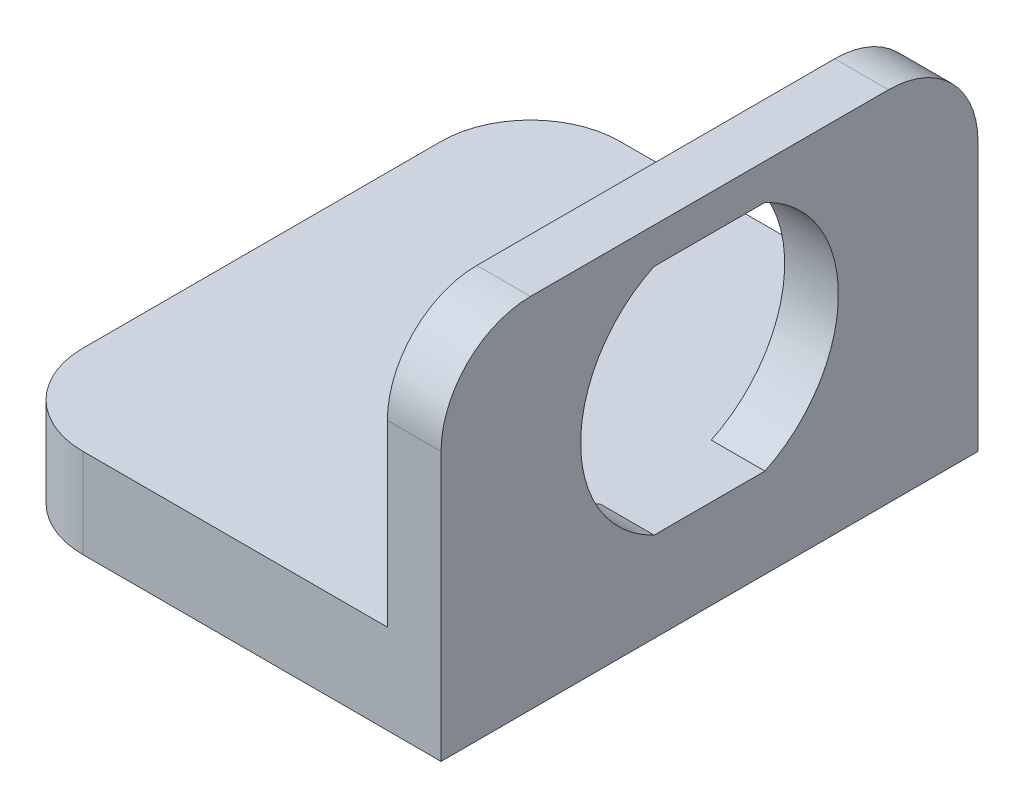
ISO-10303-21;
HEADER;
FILE_DESCRIPTION(('STEP AP214'),'2;1');
FILE_NAME('part.step','',(''),(''),'','','');
FILE_SCHEMA(('AUTOMOTIVE_DESIGN { 1 0 10303 214 1 1 1 1 }'));
ENDSEC;
DATA;
#1=APPLICATION_CONTEXT('core data for automotive mechanical design processes');
#2=APPLICATION_PROTOCOL_DEFINITION('international standard','automotive_design',2000,#1);
#3=PRODUCT_CONTEXT('',#1,'mechanical');
#4=PRODUCT('Part','Part','',(#3));
#5=PRODUCT_RELATED_PRODUCT_CATEGORY('part','',(#4));
#6=PRODUCT_DEFINITION_FORMATION('','',#4);
#7=PRODUCT_DEFINITION_CONTEXT('part definition',#1,'design');
#8=PRODUCT_DEFINITION('design','',#6,#7);
#9=PRODUCT_DEFINITION_SHAPE('','',#8);
#10=(LENGTH_UNIT() NAMED_UNIT(*) SI_UNIT(.MILLI.,.METRE.));
#11=(NAMED_UNIT(*) PLANE_ANGLE_UNIT() SI_UNIT($,.RADIAN.));
#12=(NAMED_UNIT(*) SI_UNIT($,.STERADIAN.) SOLID_ANGLE_UNIT());
#13=UNCERTAINTY_MEASURE_WITH_UNIT(LENGTH_MEASURE(1.E-05),#10,'distance_accuracy_value','');
#14=(GEOMETRIC_REPRESENTATION_CONTEXT(3) GLOBAL_UNCERTAINTY_ASSIGNED_CONTEXT((#13)) GLOBAL_UNIT_ASSIGNED_CONTEXT((#10,
#11,#12)) REPRESENTATION_CONTEXT('',''));
#15=CARTESIAN_POINT('',(0.,0.,0.));
#16=DIRECTION('',(0.,0.,1.));
#17=DIRECTION('',(1.,0.,0.));
#18=AXIS2_PLACEMENT_3D('',#15,#16,#17);
#19=CARTESIAN_POINT('',(-31.75,0.,38.1));
#20=DIRECTION('',(0.,1.,0.));
#21=DIRECTION('',(0.,0.,1.));
#22=AXIS2_PLACEMENT_3D('',#19,#20,#21);
#23=PLANE('',#22);
#24=CARTESIAN_POINT('',(-16.51,0.,19.05));
#25=DIRECTION('',(0.,1.,0.));
#26=DIRECTION('',(0.,0.,1.));
#27=AXIS2_PLACEMENT_3D('',#24,#25,#26);
#28=CIRCLE('',#27,2.5527);
#29=CARTESIAN_POINT('',(-16.51,0.,21.6027));
#30=VERTEX_POINT('',#29);
#31=EDGE_CURVE('E180',#30,#30,#28,.T.);
#32=ORIENTED_EDGE('',*,*,#31,.T.);
#33=EDGE_LOOP('',(#32));
#34=FACE_BOUND('',#33,.T.);
#35=DIRECTION('',(0.,0.,-1.));
#36=VECTOR('',#35,1.);
#37=CARTESIAN_POINT('',(-31.75,0.,38.1));
#38=LINE('',#37,#36);
#39=CARTESIAN_POINT('',(-31.75,0.,31.75));
#40=VERTEX_POINT('',#39);
#41=CARTESIAN_POINT('',(-31.75,0.,6.35000000000002));
#42=VERTEX_POINT('',#41);
#43=EDGE_CURVE('E195',#40,#42,#38,.T.);
#44=ORIENTED_EDGE('',*,*,#43,.T.);
#45=CARTESIAN_POINT('',(-25.4,0.,6.35));
#46=DIRECTION('',(0.,1.,0.));
#47=DIRECTION('',(0.,0.,1.));
#48=AXIS2_PLACEMENT_3D('',#45,#46,#47);
#49=CIRCLE('',#48,6.35);
#50=CARTESIAN_POINT('',(-25.4,0.,0.));
#51=VERTEX_POINT('',#50);
#52=EDGE_CURVE('E228',#42,#51,#49,.F.);
#53=ORIENTED_EDGE('',*,*,#52,.T.);
#54=DIRECTION('',(1.,0.,0.));
#55=VECTOR('',#54,1.);
#56=CARTESIAN_POINT('',(-31.75,0.,0.));
#57=LINE('',#56,#55);
#58=CARTESIAN_POINT('',(0.,0.,0.));
#59=VERTEX_POINT('',#58);
#60=EDGE_CURVE('E183',#51,#59,#57,.T.);
#61=ORIENTED_EDGE('',*,*,#60,.T.);
#62=DIRECTION('',(0.,0.,-1.));
#63=VECTOR('',#62,1.);
#64=CARTESIAN_POINT('',(0.,0.,38.1));
#65=LINE('',#64,#63);
#66=CARTESIAN_POINT('',(0.,0.,38.1));
#67=VERTEX_POINT('',#66);
#68=EDGE_CURVE('E215',#67,#59,#65,.T.);
#69=ORIENTED_EDGE('',*,*,#68,.F.);
#70=DIRECTION('',(1.,0.,0.));
#71=VECTOR('',#70,1.);
#72=CARTESIAN_POINT('',(-31.75,0.,38.1));
#73=LINE('',#72,#71);
#74=CARTESIAN_POINT('',(-25.4,0.,38.1));
#75=VERTEX_POINT('',#74);
#76=EDGE_CURVE('E184',#75,#67,#73,.T.);
#77=ORIENTED_EDGE('',*,*,#76,.F.);
#78=CARTESIAN_POINT('',(-25.4,0.,31.75));
#79=DIRECTION('',(0.,1.,0.));
#80=DIRECTION('',(0.,0.,1.));
#81=AXIS2_PLACEMENT_3D('',#78,#79,#80);
#82=CIRCLE('',#81,6.35);
#83=EDGE_CURVE('E226',#75,#40,#82,.F.);
#84=ORIENTED_EDGE('',*,*,#83,.T.);
#85=EDGE_LOOP('',(#44,#53,#61,#69,#77,#84));
#86=FACE_BOUND('',#85,.T.);
#87=ADVANCED_FACE('F35',(#34,#86),#23,.F.);
#88=CARTESIAN_POINT('',(0.,0.,38.1));
#89=DIRECTION('',(-1.,0.,0.));
#90=DIRECTION('',(0.,0.,1.));
#91=AXIS2_PLACEMENT_3D('',#88,#89,#90);
#92=PLANE('',#91);
#93=DIRECTION('',(0.,0.,-1.));
#94=VECTOR('',#93,1.);
#95=CARTESIAN_POINT('',(0.,6.35,15.1170989079307));
#96=LINE('',#95,#94);
#97=CARTESIAN_POINT('',(0.,6.35,22.9829010920693));
#98=VERTEX_POINT('',#97);
#99=CARTESIAN_POINT('',(0.,6.35,15.1170989079307));
#100=VERTEX_POINT('',#99);
#101=EDGE_CURVE('E153',#98,#100,#96,.T.);
#102=ORIENTED_EDGE('',*,*,#101,.F.);
#103=CARTESIAN_POINT('',(0.,14.605,19.05));
#104=DIRECTION('',(1.,0.,0.));
#105=DIRECTION('',(0.,0.,-1.));
#106=AXIS2_PLACEMENT_3D('',#103,#104,#105);
#107=CIRCLE('',#106,9.144);
#108=CARTESIAN_POINT('',(0.,22.86,22.9829010920693));
#109=VERTEX_POINT('',#108);
#110=EDGE_CURVE('E160',#109,#98,#107,.T.);
#111=ORIENTED_EDGE('',*,*,#110,.F.);
#112=DIRECTION('',(0.,0.,1.));
#113=VECTOR('',#112,1.);
#114=CARTESIAN_POINT('',(0.,22.86,22.9829010920693));
#115=LINE('',#114,#113);
#116=CARTESIAN_POINT('',(0.,22.86,15.1170989079307));
#117=VERTEX_POINT('',#116);
#118=EDGE_CURVE('E164',#117,#109,#115,.T.);
#119=ORIENTED_EDGE('',*,*,#118,.F.);
#120=CARTESIAN_POINT('',(0.,14.605,19.05));
#121=DIRECTION('',(1.,0.,0.));
#122=DIRECTION('',(0.,0.,-1.));
#123=AXIS2_PLACEMENT_3D('',#120,#121,#122);
#124=CIRCLE('',#123,9.144);
#125=EDGE_CURVE('E141',#100,#117,#124,.T.);
#126=ORIENTED_EDGE('',*,*,#125,.F.);
#127=EDGE_LOOP('',(#102,#111,#119,#126));
#128=FACE_BOUND('',#127,.T.);
#129=DIRECTION('',(0.,1.,0.));
#130=VECTOR('',#129,1.);
#131=CARTESIAN_POINT('',(0.,0.,0.));
#132=LINE('',#131,#130);
#133=CARTESIAN_POINT('',(0.,19.05,0.));
#134=VERTEX_POINT('',#133);
#135=EDGE_CURVE('E197',#59,#134,#132,.T.);
#136=ORIENTED_EDGE('',*,*,#135,.T.);
#137=CARTESIAN_POINT('',(0.,19.05,6.35));
#138=DIRECTION('',(-1.,0.,0.));
#139=DIRECTION('',(0.,0.,1.));
#140=AXIS2_PLACEMENT_3D('',#137,#138,#139);
#141=CIRCLE('',#140,6.35);
#142=CARTESIAN_POINT('',(0.,25.4,6.35000000000002));
#143=VERTEX_POINT('',#142);
#144=EDGE_CURVE('E11',#134,#143,#141,.F.);
#145=ORIENTED_EDGE('',*,*,#144,.T.);
#146=DIRECTION('',(0.,0.,-1.));
#147=VECTOR('',#146,1.);
#148=CARTESIAN_POINT('',(0.,25.4,38.1));
#149=LINE('',#148,#147);
#150=CARTESIAN_POINT('',(0.,25.4,31.75));
#151=VERTEX_POINT('',#150);
#152=EDGE_CURVE('E213',#151,#143,#149,.T.);
#153=ORIENTED_EDGE('',*,*,#152,.F.);
#154=CARTESIAN_POINT('',(0.,19.05,31.75));
#155=DIRECTION('',(-1.,0.,0.));
#156=DIRECTION('',(0.,0.,1.));
#157=AXIS2_PLACEMENT_3D('',#154,#155,#156);
#158=CIRCLE('',#157,6.35);
#159=CARTESIAN_POINT('',(0.,19.05,38.1));
#160=VERTEX_POINT('',#159);
#161=EDGE_CURVE('E43',#151,#160,#158,.F.);
#162=ORIENTED_EDGE('',*,*,#161,.T.);
#163=DIRECTION('',(0.,1.,0.));
#164=VECTOR('',#163,1.);
#165=CARTESIAN_POINT('',(0.,0.,38.1));
#166=LINE('',#165,#164);
#167=EDGE_CURVE('E186',#67,#160,#166,.T.);
#168=ORIENTED_EDGE('',*,*,#167,.F.);
#169=ORIENTED_EDGE('',*,*,#68,.T.);
#170=EDGE_LOOP('',(#136,#145,#153,#162,#168,#169));
#171=FACE_BOUND('',#170,.T.);
#172=ADVANCED_FACE('F162',(#128,#171),#92,.F.);
#173=CARTESIAN_POINT('',(0.,25.4,38.1));
#174=DIRECTION('',(0.,-1.,0.));
#175=DIRECTION('',(0.,0.,-1.));
#176=AXIS2_PLACEMENT_3D('',#173,#174,#175);
#177=PLANE('',#176);
#178=ORIENTED_EDGE('',*,*,#152,.T.);
#179=DIRECTION('',(-1.,0.,0.));
#180=VECTOR('',#179,1.);
#181=CARTESIAN_POINT('',(0.,25.4,6.35));
#182=LINE('',#181,#180);
#183=CARTESIAN_POINT('',(-3.81,25.4,6.35000000000002));
#184=VERTEX_POINT('',#183);
#185=EDGE_CURVE('E245',#143,#184,#182,.T.);
#186=ORIENTED_EDGE('',*,*,#185,.T.);
#187=DIRECTION('',(0.,0.,-1.));
#188=VECTOR('',#187,1.);
#189=CARTESIAN_POINT('',(-3.81,25.4,38.1));
#190=LINE('',#189,#188);
#191=CARTESIAN_POINT('',(-3.81,25.4,31.75));
#192=VERTEX_POINT('',#191);
#193=EDGE_CURVE('E210',#192,#184,#190,.T.);
#194=ORIENTED_EDGE('',*,*,#193,.F.);
#195=DIRECTION('',(-1.,0.,0.));
#196=VECTOR('',#195,1.);
#197=CARTESIAN_POINT('',(0.,25.4,31.75));
#198=LINE('',#197,#196);
#199=EDGE_CURVE('E55',#192,#151,#198,.F.);
#200=ORIENTED_EDGE('',*,*,#199,.T.);
#201=EDGE_LOOP('',(#178,#186,#194,#200));
#202=FACE_BOUND('',#201,.T.);
#203=ADVANCED_FACE('F263',(#202),#177,.F.);
#204=CARTESIAN_POINT('',(-3.81,25.4,38.1));
#205=DIRECTION('',(1.,0.,0.));
#206=DIRECTION('',(0.,1.,0.));
#207=AXIS2_PLACEMENT_3D('',#204,#205,#206);
#208=PLANE('',#207);
#209=ORIENTED_EDGE('',*,*,#193,.T.);
#210=CARTESIAN_POINT('',(-3.81,19.05,6.35));
#211=DIRECTION('',(1.,0.,0.));
#212=DIRECTION('',(0.,1.,0.));
#213=AXIS2_PLACEMENT_3D('',#210,#211,#212);
#214=CIRCLE('',#213,6.35);
#215=CARTESIAN_POINT('',(-3.81,19.05,0.));
#216=VERTEX_POINT('',#215);
#217=EDGE_CURVE('E250',#184,#216,#214,.F.);
#218=ORIENTED_EDGE('',*,*,#217,.T.);
#219=DIRECTION('',(0.,-1.,0.));
#220=VECTOR('',#219,1.);
#221=CARTESIAN_POINT('',(-3.81,25.4,0.));
#222=LINE('',#221,#220);
#223=CARTESIAN_POINT('',(-3.81,6.35,0.));
#224=VERTEX_POINT('',#223);
#225=EDGE_CURVE('E199',#216,#224,#222,.T.);
#226=ORIENTED_EDGE('',*,*,#225,.T.);
#227=DIRECTION('',(0.,0.,-1.));
#228=VECTOR('',#227,1.);
#229=CARTESIAN_POINT('',(-3.81,6.35,38.1));
#230=LINE('',#229,#228);
#231=CARTESIAN_POINT('',(-3.81,6.35,15.1170989079307));
#232=VERTEX_POINT('',#231);
#233=EDGE_CURVE('E207',#232,#224,#230,.T.);
#234=ORIENTED_EDGE('',*,*,#233,.F.);
#235=CARTESIAN_POINT('',(-3.81,14.605,19.05));
#236=DIRECTION('',(1.,0.,0.));
#237=DIRECTION('',(0.,1.,0.));
#238=AXIS2_PLACEMENT_3D('',#235,#236,#237);
#239=CIRCLE('',#238,9.144);
#240=CARTESIAN_POINT('',(-3.81,22.86,15.1170989079307));
#241=VERTEX_POINT('',#240);
#242=EDGE_CURVE('E144',#232,#241,#239,.T.);
#243=ORIENTED_EDGE('',*,*,#242,.T.);
#244=DIRECTION('',(0.,0.,1.));
#245=VECTOR('',#244,1.);
#246=CARTESIAN_POINT('',(-3.81,22.86,38.1));
#247=LINE('',#246,#245);
#248=CARTESIAN_POINT('',(-3.81,22.86,22.9829010920693));
#249=VERTEX_POINT('',#248);
#250=EDGE_CURVE('E218',#241,#249,#247,.T.);
#251=ORIENTED_EDGE('',*,*,#250,.T.);
#252=CARTESIAN_POINT('',(-3.81,14.605,19.05));
#253=DIRECTION('',(1.,0.,0.));
#254=DIRECTION('',(0.,1.,0.));
#255=AXIS2_PLACEMENT_3D('',#252,#253,#254);
#256=CIRCLE('',#255,9.144);
#257=CARTESIAN_POINT('',(-3.81,6.35,22.9829010920693));
#258=VERTEX_POINT('',#257);
#259=EDGE_CURVE('E174',#249,#258,#256,.T.);
#260=ORIENTED_EDGE('',*,*,#259,.T.);
#261=CARTESIAN_POINT('',(-3.81,6.35,38.1));
#262=VERTEX_POINT('',#261);
#263=EDGE_CURVE('E208',#262,#258,#230,.T.);
#264=ORIENTED_EDGE('',*,*,#263,.F.);
#265=DIRECTION('',(0.,-1.,0.));
#266=VECTOR('',#265,1.);
#267=CARTESIAN_POINT('',(-3.81,25.4,38.1));
#268=LINE('',#267,#266);
#269=CARTESIAN_POINT('',(-3.81,19.05,38.1));
#270=VERTEX_POINT('',#269);
#271=EDGE_CURVE('E190',#270,#262,#268,.T.);
#272=ORIENTED_EDGE('',*,*,#271,.F.);
#273=CARTESIAN_POINT('',(-3.81,19.05,31.75));
#274=DIRECTION('',(1.,0.,0.));
#275=DIRECTION('',(0.,1.,0.));
#276=AXIS2_PLACEMENT_3D('',#273,#274,#275);
#277=CIRCLE('',#276,6.35);
#278=EDGE_CURVE('E248',#270,#192,#277,.F.);
#279=ORIENTED_EDGE('',*,*,#278,.T.);
#280=EDGE_LOOP('',(#209,#218,#226,#234,#243,#251,#260,#264,#272,#279));
#281=FACE_BOUND('',#280,.T.);
#282=ADVANCED_FACE('F261',(#281),#208,.F.);
#283=CARTESIAN_POINT('',(-3.81,6.35,38.1));
#284=DIRECTION('',(0.,-1.,0.));
#285=DIRECTION('',(1.,0.,0.));
#286=AXIS2_PLACEMENT_3D('',#283,#284,#285);
#287=PLANE('',#286);
#288=DIRECTION('',(-1.,0.,0.));
#289=VECTOR('',#288,1.);
#290=CARTESIAN_POINT('',(-3.81,6.35,0.));
#291=LINE('',#290,#289);
#292=CARTESIAN_POINT('',(-25.4,6.35,0.));
#293=VERTEX_POINT('',#292);
#294=EDGE_CURVE('E187',#224,#293,#291,.T.);
#295=ORIENTED_EDGE('',*,*,#294,.T.);
#296=CARTESIAN_POINT('',(-25.4,6.35,6.35));
#297=DIRECTION('',(0.,-1.,0.));
#298=DIRECTION('',(1.,0.,0.));
#299=AXIS2_PLACEMENT_3D('',#296,#297,#298);
#300=CIRCLE('',#299,6.35);
#301=CARTESIAN_POINT('',(-31.75,6.35,6.35000000000002));
#302=VERTEX_POINT('',#301);
#303=EDGE_CURVE('E236',#293,#302,#300,.F.);
#304=ORIENTED_EDGE('',*,*,#303,.T.);
#305=DIRECTION('',(0.,0.,-1.));
#306=VECTOR('',#305,1.);
#307=CARTESIAN_POINT('',(-31.75,6.35,38.1));
#308=LINE('',#307,#306);
#309=CARTESIAN_POINT('',(-31.75,6.35,31.75));
#310=VERTEX_POINT('',#309);
#311=EDGE_CURVE('E204',#310,#302,#308,.T.);
#312=ORIENTED_EDGE('',*,*,#311,.F.);
#313=CARTESIAN_POINT('',(-25.4,6.35,31.75));
#314=DIRECTION('',(0.,-1.,0.));
#315=DIRECTION('',(1.,0.,0.));
#316=AXIS2_PLACEMENT_3D('',#313,#314,#315);
#317=CIRCLE('',#316,6.35);
#318=CARTESIAN_POINT('',(-25.4,6.35,38.1));
#319=VERTEX_POINT('',#318);
#320=EDGE_CURVE('E234',#310,#319,#317,.F.);
#321=ORIENTED_EDGE('',*,*,#320,.T.);
#322=DIRECTION('',(-1.,0.,0.));
#323=VECTOR('',#322,1.);
#324=CARTESIAN_POINT('',(-3.81,6.35,38.1));
#325=LINE('',#324,#323);
#326=EDGE_CURVE('E192',#262,#319,#325,.T.);
#327=ORIENTED_EDGE('',*,*,#326,.F.);
#328=ORIENTED_EDGE('',*,*,#263,.T.);
#329=DIRECTION('',(1.,0.,0.));
#330=VECTOR('',#329,1.);
#331=CARTESIAN_POINT('',(-31.75,6.35,22.9829010920693));
#332=LINE('',#331,#330);
#333=EDGE_CURVE('E149',#258,#98,#332,.T.);
#334=ORIENTED_EDGE('',*,*,#333,.T.);
#335=ORIENTED_EDGE('',*,*,#101,.T.);
#336=DIRECTION('',(1.,0.,0.));
#337=VECTOR('',#336,1.);
#338=CARTESIAN_POINT('',(-31.75,6.35,15.1170989079307));
#339=LINE('',#338,#337);
#340=EDGE_CURVE('E136',#232,#100,#339,.T.);
#341=ORIENTED_EDGE('',*,*,#340,.F.);
#342=ORIENTED_EDGE('',*,*,#233,.T.);
#343=EDGE_LOOP('',(#295,#304,#312,#321,#327,#328,#334,#335,#341,#342));
#344=FACE_BOUND('',#343,.T.);
#345=CARTESIAN_POINT('',(-16.51,6.35,19.05));
#346=DIRECTION('',(0.,1.,0.));
#347=DIRECTION('',(0.,0.,1.));
#348=AXIS2_PLACEMENT_3D('',#345,#346,#347);
#349=CIRCLE('',#348,2.5527);
#350=CARTESIAN_POINT('',(-16.51,6.35,21.6027));
#351=VERTEX_POINT('',#350);
#352=EDGE_CURVE('E177',#351,#351,#349,.T.);
#353=ORIENTED_EDGE('',*,*,#352,.F.);
#354=EDGE_LOOP('',(#353));
#355=FACE_BOUND('',#354,.T.);
#356=ADVANCED_FACE('F155',(#344,#355),#287,.F.);
#357=CARTESIAN_POINT('',(-31.75,6.35,38.1));
#358=DIRECTION('',(1.,0.,0.));
#359=DIRECTION('',(0.,0.,-1.));
#360=AXIS2_PLACEMENT_3D('',#357,#358,#359);
#361=PLANE('',#360);
#362=ORIENTED_EDGE('',*,*,#311,.T.);
#363=DIRECTION('',(0.,-1.,0.));
#364=VECTOR('',#363,1.);
#365=CARTESIAN_POINT('',(-31.75,6.35,6.35));
#366=LINE('',#365,#364);
#367=EDGE_CURVE('E223',#302,#42,#366,.T.);
#368=ORIENTED_EDGE('',*,*,#367,.T.);
#369=ORIENTED_EDGE('',*,*,#43,.F.);
#370=DIRECTION('',(0.,-1.,0.));
#371=VECTOR('',#370,1.);
#372=CARTESIAN_POINT('',(-31.75,6.35,31.75));
#373=LINE('',#372,#371);
#374=EDGE_CURVE('E221',#40,#310,#373,.F.);
#375=ORIENTED_EDGE('',*,*,#374,.T.);
#376=EDGE_LOOP('',(#362,#368,#369,#375));
#377=FACE_BOUND('',#376,.T.);
#378=ADVANCED_FACE('F282',(#377),#361,.F.);
#379=CARTESIAN_POINT('',(0.,0.,38.1));
#380=DIRECTION('',(0.,0.,1.));
#381=DIRECTION('',(1.,0.,0.));
#382=AXIS2_PLACEMENT_3D('',#379,#380,#381);
#383=PLANE('',#382);
#384=ORIENTED_EDGE('',*,*,#326,.T.);
#385=DIRECTION('',(0.,-1.,0.));
#386=VECTOR('',#385,1.);
#387=CARTESIAN_POINT('',(-25.4,0.,38.1));
#388=LINE('',#387,#386);
#389=EDGE_CURVE('E241',#319,#75,#388,.T.);
#390=ORIENTED_EDGE('',*,*,#389,.T.);
#391=ORIENTED_EDGE('',*,*,#76,.T.);
#392=ORIENTED_EDGE('',*,*,#167,.T.);
#393=DIRECTION('',(-1.,0.,0.));
#394=VECTOR('',#393,1.);
#395=CARTESIAN_POINT('',(-3.81,19.05,38.1));
#396=LINE('',#395,#394);
#397=EDGE_CURVE('E238',#160,#270,#396,.T.);
#398=ORIENTED_EDGE('',*,*,#397,.T.);
#399=ORIENTED_EDGE('',*,*,#271,.T.);
#400=EDGE_LOOP('',(#384,#390,#391,#392,#398,#399));
#401=FACE_BOUND('',#400,.T.);
#402=ADVANCED_FACE('F257',(#401),#383,.T.);
#403=CARTESIAN_POINT('',(0.,0.,0.));
#404=DIRECTION('',(0.,0.,1.));
#405=DIRECTION('',(1.,0.,0.));
#406=AXIS2_PLACEMENT_3D('',#403,#404,#405);
#407=PLANE('',#406);
#408=ORIENTED_EDGE('',*,*,#60,.F.);
#409=DIRECTION('',(0.,-1.,0.));
#410=VECTOR('',#409,1.);
#411=CARTESIAN_POINT('',(-25.4,0.,0.));
#412=LINE('',#411,#410);
#413=EDGE_CURVE('E232',#51,#293,#412,.F.);
#414=ORIENTED_EDGE('',*,*,#413,.T.);
#415=ORIENTED_EDGE('',*,*,#294,.F.);
#416=ORIENTED_EDGE('',*,*,#225,.F.);
#417=DIRECTION('',(-1.,0.,0.));
#418=VECTOR('',#417,1.);
#419=CARTESIAN_POINT('',(0.,19.05,0.));
#420=LINE('',#419,#418);
#421=EDGE_CURVE('E230',#216,#134,#420,.F.);
#422=ORIENTED_EDGE('',*,*,#421,.T.);
#423=ORIENTED_EDGE('',*,*,#135,.F.);
#424=EDGE_LOOP('',(#408,#414,#415,#416,#422,#423));
#425=FACE_BOUND('',#424,.T.);
#426=ADVANCED_FACE('F272',(#425),#407,.F.);
#427=CARTESIAN_POINT('',(-16.51,6.35,19.05));
#428=DIRECTION('',(0.,1.,0.));
#429=DIRECTION('',(0.,0.,1.));
#430=AXIS2_PLACEMENT_3D('',#427,#428,#429);
#431=CYLINDRICAL_SURFACE('',#430,2.5527);
#432=ORIENTED_EDGE('',*,*,#31,.F.);
#433=EDGE_LOOP('',(#432));
#434=FACE_BOUND('',#433,.T.);
#435=ORIENTED_EDGE('',*,*,#352,.T.);
#436=EDGE_LOOP('',(#435));
#437=FACE_BOUND('',#436,.T.);
#438=ADVANCED_FACE('F296',(#434,#437),#431,.F.);
#439=CARTESIAN_POINT('',(-31.75,22.86,22.9829010920693));
#440=DIRECTION('',(0.,1.,0.));
#441=DIRECTION('',(0.,0.,1.));
#442=AXIS2_PLACEMENT_3D('',#439,#440,#441);
#443=PLANE('',#442);
#444=DIRECTION('',(1.,0.,0.));
#445=VECTOR('',#444,1.);
#446=CARTESIAN_POINT('',(-31.75,22.86,15.1170989079307));
#447=LINE('',#446,#445);
#448=EDGE_CURVE('E148',#241,#117,#447,.T.);
#449=ORIENTED_EDGE('',*,*,#448,.T.);
#450=ORIENTED_EDGE('',*,*,#118,.T.);
#451=DIRECTION('',(1.,0.,0.));
#452=VECTOR('',#451,1.);
#453=CARTESIAN_POINT('',(-31.75,22.86,22.9829010920693));
#454=LINE('',#453,#452);
#455=EDGE_CURVE('E169',#249,#109,#454,.T.);
#456=ORIENTED_EDGE('',*,*,#455,.F.);
#457=ORIENTED_EDGE('',*,*,#250,.F.);
#458=EDGE_LOOP('',(#449,#450,#456,#457));
#459=FACE_BOUND('',#458,.T.);
#460=ADVANCED_FACE('F294',(#459),#443,.F.);
#461=CARTESIAN_POINT('',(-31.75,14.605,19.05));
#462=DIRECTION('',(1.,0.,0.));
#463=DIRECTION('',(0.,0.,-1.));
#464=AXIS2_PLACEMENT_3D('',#461,#462,#463);
#465=CYLINDRICAL_SURFACE('',#464,9.144);
#466=ORIENTED_EDGE('',*,*,#455,.T.);
#467=ORIENTED_EDGE('',*,*,#110,.T.);
#468=ORIENTED_EDGE('',*,*,#333,.F.);
#469=ORIENTED_EDGE('',*,*,#259,.F.);
#470=EDGE_LOOP('',(#466,#467,#468,#469));
#471=FACE_BOUND('',#470,.T.);
#472=ADVANCED_FACE('F292',(#471),#465,.F.);
#473=CARTESIAN_POINT('',(-31.75,14.605,19.05));
#474=DIRECTION('',(1.,0.,0.));
#475=DIRECTION('',(0.,0.,-1.));
#476=AXIS2_PLACEMENT_3D('',#473,#474,#475);
#477=CYLINDRICAL_SURFACE('',#476,9.144);
#478=ORIENTED_EDGE('',*,*,#340,.T.);
#479=ORIENTED_EDGE('',*,*,#125,.T.);
#480=ORIENTED_EDGE('',*,*,#448,.F.);
#481=ORIENTED_EDGE('',*,*,#242,.F.);
#482=EDGE_LOOP('',(#478,#479,#480,#481));
#483=FACE_BOUND('',#482,.T.);
#484=ADVANCED_FACE('F138',(#483),#477,.F.);
#485=CARTESIAN_POINT('',(-25.4,6.35,6.35));
#486=DIRECTION('',(0.,-1.,0.));
#487=DIRECTION('',(0.,0.,-1.));
#488=AXIS2_PLACEMENT_3D('',#485,#486,#487);
#489=CYLINDRICAL_SURFACE('',#488,6.35);
#490=ORIENTED_EDGE('',*,*,#303,.F.);
#491=ORIENTED_EDGE('',*,*,#413,.F.);
#492=ORIENTED_EDGE('',*,*,#52,.F.);
#493=ORIENTED_EDGE('',*,*,#367,.F.);
#494=EDGE_LOOP('',(#490,#491,#492,#493));
#495=FACE_BOUND('',#494,.T.);
#496=ADVANCED_FACE('F279',(#495),#489,.T.);
#497=CARTESIAN_POINT('',(-25.4,0.,31.75));
#498=DIRECTION('',(0.,1.,0.));
#499=DIRECTION('',(0.,0.,1.));
#500=AXIS2_PLACEMENT_3D('',#497,#498,#499);
#501=CYLINDRICAL_SURFACE('',#500,6.35);
#502=ORIENTED_EDGE('',*,*,#320,.F.);
#503=ORIENTED_EDGE('',*,*,#374,.F.);
#504=ORIENTED_EDGE('',*,*,#83,.F.);
#505=ORIENTED_EDGE('',*,*,#389,.F.);
#506=EDGE_LOOP('',(#502,#503,#504,#505));
#507=FACE_BOUND('',#506,.T.);
#508=ADVANCED_FACE('F288',(#507),#501,.T.);
#509=CARTESIAN_POINT('',(0.,19.05,6.35));
#510=DIRECTION('',(-1.,0.,0.));
#511=DIRECTION('',(0.,0.,1.));
#512=AXIS2_PLACEMENT_3D('',#509,#510,#511);
#513=CYLINDRICAL_SURFACE('',#512,6.35);
#514=ORIENTED_EDGE('',*,*,#144,.F.);
#515=ORIENTED_EDGE('',*,*,#421,.F.);
#516=ORIENTED_EDGE('',*,*,#217,.F.);
#517=ORIENTED_EDGE('',*,*,#185,.F.);
#518=EDGE_LOOP('',(#514,#515,#516,#517));
#519=FACE_BOUND('',#518,.T.);
#520=ADVANCED_FACE('F266',(#519),#513,.T.);
#521=CARTESIAN_POINT('',(0.,19.05,31.75));
#522=DIRECTION('',(1.,0.,0.));
#523=DIRECTION('',(0.,0.,-1.));
#524=AXIS2_PLACEMENT_3D('',#521,#522,#523);
#525=CYLINDRICAL_SURFACE('',#524,6.35);
#526=ORIENTED_EDGE('',*,*,#161,.F.);
#527=ORIENTED_EDGE('',*,*,#199,.F.);
#528=ORIENTED_EDGE('',*,*,#278,.F.);
#529=ORIENTED_EDGE('',*,*,#397,.F.);
#530=EDGE_LOOP('',(#526,#527,#528,#529));
#531=FACE_BOUND('',#530,.T.);
#532=ADVANCED_FACE('F37',(#531),#525,.T.);
#533=CLOSED_SHELL('',(#87,#172,#203,#282,#356,#378,#402,#426,#438,#460,#472,#484,#496,#508,#520,#532));
#534=MANIFOLD_SOLID_BREP('B2',#533);
#535=ADVANCED_BREP_SHAPE_REPRESENTATION('',(#18,#534),#14);
#536=SHAPE_DEFINITION_REPRESENTATION(#9,#535);
ENDSEC;
END-ISO-10303-21;
